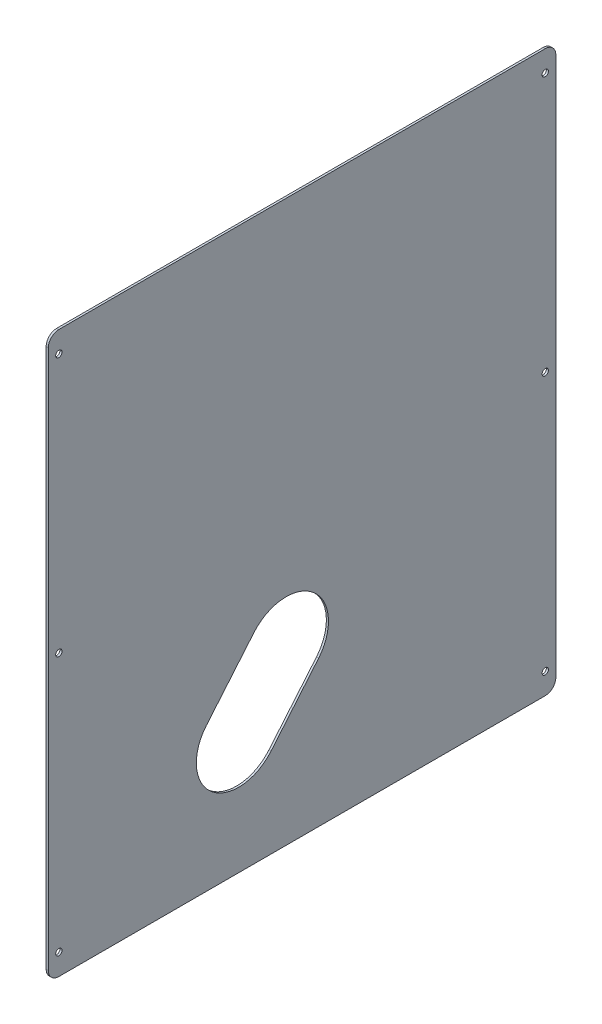
ISO-10303-21;
HEADER;
FILE_DESCRIPTION(('STEP AP214'),'2;1');
FILE_NAME('part.step','',(''),(''),'','','');
FILE_SCHEMA(('AUTOMOTIVE_DESIGN { 1 0 10303 214 1 1 1 1 }'));
ENDSEC;
DATA;
#1=APPLICATION_CONTEXT('core data for automotive mechanical design processes');
#2=APPLICATION_PROTOCOL_DEFINITION('international standard','automotive_design',2000,#1);
#3=PRODUCT_CONTEXT('',#1,'mechanical');
#4=PRODUCT('Part','Part','',(#3));
#5=PRODUCT_RELATED_PRODUCT_CATEGORY('part','',(#4));
#6=PRODUCT_DEFINITION_FORMATION('','',#4);
#7=PRODUCT_DEFINITION_CONTEXT('part definition',#1,'design');
#8=PRODUCT_DEFINITION('design','',#6,#7);
#9=PRODUCT_DEFINITION_SHAPE('','',#8);
#10=(LENGTH_UNIT() NAMED_UNIT(*) SI_UNIT(.MILLI.,.METRE.));
#11=(NAMED_UNIT(*) PLANE_ANGLE_UNIT() SI_UNIT($,.RADIAN.));
#12=(NAMED_UNIT(*) SI_UNIT($,.STERADIAN.) SOLID_ANGLE_UNIT());
#13=UNCERTAINTY_MEASURE_WITH_UNIT(LENGTH_MEASURE(1.E-05),#10,'distance_accuracy_value','');
#14=(GEOMETRIC_REPRESENTATION_CONTEXT(3) GLOBAL_UNCERTAINTY_ASSIGNED_CONTEXT((#13)) GLOBAL_UNIT_ASSIGNED_CONTEXT((#10,
#11,#12)) REPRESENTATION_CONTEXT('',''));
#15=CARTESIAN_POINT('',(0.,0.,0.));
#16=DIRECTION('',(0.,0.,1.));
#17=DIRECTION('',(1.,0.,0.));
#18=AXIS2_PLACEMENT_3D('',#15,#16,#17);
#19=CARTESIAN_POINT('',(-2.,-265.,-240.));
#20=DIRECTION('',(0.,0.,-1.));
#21=DIRECTION('',(-1.,0.,0.));
#22=AXIS2_PLACEMENT_3D('',#19,#20,#21);
#23=PLANE('',#22);
#24=DIRECTION('',(0.,1.,0.));
#25=VECTOR('',#24,1.);
#26=CARTESIAN_POINT('',(0.,-265.,-240.));
#27=LINE('',#26,#25);
#28=CARTESIAN_POINT('',(0.,-255.,-240.));
#29=VERTEX_POINT('',#28);
#30=CARTESIAN_POINT('',(0.,255.,-240.));
#31=VERTEX_POINT('',#30);
#32=EDGE_CURVE('E217',#29,#31,#27,.T.);
#33=ORIENTED_EDGE('',*,*,#32,.F.);
#34=DIRECTION('',(1.,0.,0.));
#35=VECTOR('',#34,1.);
#36=CARTESIAN_POINT('',(-2.,-255.,-240.));
#37=LINE('',#36,#35);
#38=CARTESIAN_POINT('',(-2.,-255.,-240.));
#39=VERTEX_POINT('',#38);
#40=EDGE_CURVE('E308',#29,#39,#37,.F.);
#41=ORIENTED_EDGE('',*,*,#40,.T.);
#42=DIRECTION('',(0.,1.,0.));
#43=VECTOR('',#42,1.);
#44=CARTESIAN_POINT('',(-2.,-265.,-240.));
#45=LINE('',#44,#43);
#46=CARTESIAN_POINT('',(-2.,255.,-240.));
#47=VERTEX_POINT('',#46);
#48=EDGE_CURVE('E237',#39,#47,#45,.T.);
#49=ORIENTED_EDGE('',*,*,#48,.T.);
#50=DIRECTION('',(1.,0.,0.));
#51=VECTOR('',#50,1.);
#52=CARTESIAN_POINT('',(-2.,255.,-240.));
#53=LINE('',#52,#51);
#54=EDGE_CURVE('E304',#47,#31,#53,.T.);
#55=ORIENTED_EDGE('',*,*,#54,.T.);
#56=EDGE_LOOP('',(#33,#41,#49,#55));
#57=FACE_BOUND('',#56,.T.);
#58=ADVANCED_FACE('F42',(#57),#23,.T.);
#59=CARTESIAN_POINT('',(-2.,-265.,240.));
#60=DIRECTION('',(0.,-1.,0.));
#61=DIRECTION('',(0.,0.,-1.));
#62=AXIS2_PLACEMENT_3D('',#59,#60,#61);
#63=PLANE('',#62);
#64=DIRECTION('',(0.,0.,-1.));
#65=VECTOR('',#64,1.);
#66=CARTESIAN_POINT('',(0.,-265.,240.));
#67=LINE('',#66,#65);
#68=CARTESIAN_POINT('',(0.,-265.,230.));
#69=VERTEX_POINT('',#68);
#70=CARTESIAN_POINT('',(0.,-265.,-230.));
#71=VERTEX_POINT('',#70);
#72=EDGE_CURVE('E242',#69,#71,#67,.T.);
#73=ORIENTED_EDGE('',*,*,#72,.F.);
#74=DIRECTION('',(1.,0.,0.));
#75=VECTOR('',#74,1.);
#76=CARTESIAN_POINT('',(-2.,-265.,230.));
#77=LINE('',#76,#75);
#78=CARTESIAN_POINT('',(-2.,-265.,230.));
#79=VERTEX_POINT('',#78);
#80=EDGE_CURVE('E290',#69,#79,#77,.F.);
#81=ORIENTED_EDGE('',*,*,#80,.T.);
#82=DIRECTION('',(0.,0.,-1.));
#83=VECTOR('',#82,1.);
#84=CARTESIAN_POINT('',(-2.,-265.,240.));
#85=LINE('',#84,#83);
#86=CARTESIAN_POINT('',(-2.,-265.,-230.));
#87=VERTEX_POINT('',#86);
#88=EDGE_CURVE('E249',#79,#87,#85,.T.);
#89=ORIENTED_EDGE('',*,*,#88,.T.);
#90=DIRECTION('',(1.,0.,0.));
#91=VECTOR('',#90,1.);
#92=CARTESIAN_POINT('',(-2.,-265.,-230.));
#93=LINE('',#92,#91);
#94=EDGE_CURVE('E286',#87,#71,#93,.T.);
#95=ORIENTED_EDGE('',*,*,#94,.T.);
#96=EDGE_LOOP('',(#73,#81,#89,#95));
#97=FACE_BOUND('',#96,.T.);
#98=ADVANCED_FACE('F334',(#97),#63,.T.);
#99=CARTESIAN_POINT('',(-2.,-265.,240.));
#100=DIRECTION('',(0.,0.,1.));
#101=DIRECTION('',(1.,0.,0.));
#102=AXIS2_PLACEMENT_3D('',#99,#100,#101);
#103=PLANE('',#102);
#104=DIRECTION('',(0.,-1.,0.));
#105=VECTOR('',#104,1.);
#106=CARTESIAN_POINT('',(-2.,-265.,240.));
#107=LINE('',#106,#105);
#108=CARTESIAN_POINT('',(-2.,255.,240.));
#109=VERTEX_POINT('',#108);
#110=CARTESIAN_POINT('',(-2.,-255.,240.));
#111=VERTEX_POINT('',#110);
#112=EDGE_CURVE('E245',#109,#111,#107,.T.);
#113=ORIENTED_EDGE('',*,*,#112,.T.);
#114=DIRECTION('',(1.,0.,0.));
#115=VECTOR('',#114,1.);
#116=CARTESIAN_POINT('',(-2.,-255.,240.));
#117=LINE('',#116,#115);
#118=CARTESIAN_POINT('',(0.,-255.,240.));
#119=VERTEX_POINT('',#118);
#120=EDGE_CURVE('E270',#111,#119,#117,.T.);
#121=ORIENTED_EDGE('',*,*,#120,.T.);
#122=DIRECTION('',(0.,-1.,0.));
#123=VECTOR('',#122,1.);
#124=CARTESIAN_POINT('',(0.,-265.,240.));
#125=LINE('',#124,#123);
#126=CARTESIAN_POINT('',(0.,255.,240.));
#127=VERTEX_POINT('',#126);
#128=EDGE_CURVE('E261',#127,#119,#125,.T.);
#129=ORIENTED_EDGE('',*,*,#128,.F.);
#130=DIRECTION('',(1.,0.,0.));
#131=VECTOR('',#130,1.);
#132=CARTESIAN_POINT('',(-2.,255.,240.));
#133=LINE('',#132,#131);
#134=EDGE_CURVE('E253',#127,#109,#133,.F.);
#135=ORIENTED_EDGE('',*,*,#134,.T.);
#136=EDGE_LOOP('',(#113,#121,#129,#135));
#137=FACE_BOUND('',#136,.T.);
#138=ADVANCED_FACE('F341',(#137),#103,.T.);
#139=CARTESIAN_POINT('',(-2.,265.,240.));
#140=DIRECTION('',(0.,1.,0.));
#141=DIRECTION('',(0.,0.,1.));
#142=AXIS2_PLACEMENT_3D('',#139,#140,#141);
#143=PLANE('',#142);
#144=DIRECTION('',(0.,0.,1.));
#145=VECTOR('',#144,1.);
#146=CARTESIAN_POINT('',(0.,265.,240.));
#147=LINE('',#146,#145);
#148=CARTESIAN_POINT('',(0.,265.,-230.));
#149=VERTEX_POINT('',#148);
#150=CARTESIAN_POINT('',(0.,265.,230.));
#151=VERTEX_POINT('',#150);
#152=EDGE_CURVE('E257',#149,#151,#147,.T.);
#153=ORIENTED_EDGE('',*,*,#152,.F.);
#154=DIRECTION('',(1.,0.,0.));
#155=VECTOR('',#154,1.);
#156=CARTESIAN_POINT('',(-2.,265.,-230.));
#157=LINE('',#156,#155);
#158=CARTESIAN_POINT('',(-2.,265.,-230.));
#159=VERTEX_POINT('',#158);
#160=EDGE_CURVE('E11',#149,#159,#157,.F.);
#161=ORIENTED_EDGE('',*,*,#160,.T.);
#162=DIRECTION('',(0.,0.,1.));
#163=VECTOR('',#162,1.);
#164=CARTESIAN_POINT('',(-2.,265.,240.));
#165=LINE('',#164,#163);
#166=CARTESIAN_POINT('',(-2.,265.,230.));
#167=VERTEX_POINT('',#166);
#168=EDGE_CURVE('E241',#159,#167,#165,.T.);
#169=ORIENTED_EDGE('',*,*,#168,.T.);
#170=DIRECTION('',(1.,0.,0.));
#171=VECTOR('',#170,1.);
#172=CARTESIAN_POINT('',(-2.,265.,230.));
#173=LINE('',#172,#171);
#174=EDGE_CURVE('E51',#167,#151,#173,.T.);
#175=ORIENTED_EDGE('',*,*,#174,.T.);
#176=EDGE_LOOP('',(#153,#161,#169,#175));
#177=FACE_BOUND('',#176,.T.);
#178=ADVANCED_FACE('F314',(#177),#143,.T.);
#179=CARTESIAN_POINT('',(-2.,0.,0.));
#180=DIRECTION('',(-1.,0.,0.));
#181=DIRECTION('',(0.,0.,1.));
#182=AXIS2_PLACEMENT_3D('',#179,#180,#181);
#183=PLANE('',#182);
#184=CARTESIAN_POINT('',(-2.,-155.,60.));
#185=DIRECTION('',(1.,0.,0.));
#186=DIRECTION('',(0.,0.,-1.));
#187=AXIS2_PLACEMENT_3D('',#184,#185,#186);
#188=CIRCLE('',#187,40.);
#189=CARTESIAN_POINT('',(-2.,-129.288495612539,90.6417777247592));
#190=VERTEX_POINT('',#189);
#191=CARTESIAN_POINT('',(-2.,-180.711504387462,29.3582222752409));
#192=VERTEX_POINT('',#191);
#193=EDGE_CURVE('E136',#190,#192,#188,.T.);
#194=ORIENTED_EDGE('',*,*,#193,.T.);
#195=DIRECTION('',(0.,0.766044443118979,-0.642787609686538));
#196=VECTOR('',#195,1.);
#197=CARTESIAN_POINT('',(-2.,-180.711504387462,29.3582222752409));
#198=LINE('',#197,#196);
#199=CARTESIAN_POINT('',(-2.,-127.088393369133,-15.6369104028168));
#200=VERTEX_POINT('',#199);
#201=EDGE_CURVE('E149',#192,#200,#198,.T.);
#202=ORIENTED_EDGE('',*,*,#201,.T.);
#203=CARTESIAN_POINT('',(-2.,-101.376888981671,15.0048673219424));
#204=DIRECTION('',(1.,0.,0.));
#205=DIRECTION('',(0.,0.,-1.));
#206=AXIS2_PLACEMENT_3D('',#203,#204,#205);
#207=CIRCLE('',#206,40.);
#208=CARTESIAN_POINT('',(-2.,-75.6653845942101,45.6466450467015));
#209=VERTEX_POINT('',#208);
#210=EDGE_CURVE('E154',#200,#209,#207,.T.);
#211=ORIENTED_EDGE('',*,*,#210,.T.);
#212=DIRECTION('',(0.,-0.766044443118979,0.642787609686538));
#213=VECTOR('',#212,1.);
#214=CARTESIAN_POINT('',(-2.,-129.288495612539,90.6417777247592));
#215=LINE('',#214,#213);
#216=EDGE_CURVE('E145',#209,#190,#215,.T.);
#217=ORIENTED_EDGE('',*,*,#216,.T.);
#218=EDGE_LOOP('',(#194,#202,#211,#217));
#219=FACE_BOUND('',#218,.T.);
#220=CARTESIAN_POINT('',(-2.,245.,-230.));
#221=DIRECTION('',(-1.,0.,0.));
#222=DIRECTION('',(0.,0.,1.));
#223=AXIS2_PLACEMENT_3D('',#220,#221,#222);
#224=CIRCLE('',#223,2.99999999999999);
#225=CARTESIAN_POINT('',(-2.,245.,-227.));
#226=VERTEX_POINT('',#225);
#227=EDGE_CURVE('E193',#226,#226,#224,.T.);
#228=ORIENTED_EDGE('',*,*,#227,.F.);
#229=EDGE_LOOP('',(#228));
#230=FACE_BOUND('',#229,.T.);
#231=CARTESIAN_POINT('',(-2.,0.,-230.));
#232=DIRECTION('',(-1.,0.,0.));
#233=DIRECTION('',(0.,0.,1.));
#234=AXIS2_PLACEMENT_3D('',#231,#232,#233);
#235=CIRCLE('',#234,2.99999999999999);
#236=CARTESIAN_POINT('',(-2.,0.,-227.));
#237=VERTEX_POINT('',#236);
#238=EDGE_CURVE('E194',#237,#237,#235,.T.);
#239=ORIENTED_EDGE('',*,*,#238,.F.);
#240=EDGE_LOOP('',(#239));
#241=FACE_BOUND('',#240,.T.);
#242=CARTESIAN_POINT('',(-2.,-245.,-230.));
#243=DIRECTION('',(-1.,0.,0.));
#244=DIRECTION('',(0.,0.,1.));
#245=AXIS2_PLACEMENT_3D('',#242,#243,#244);
#246=CIRCLE('',#245,2.99999999999999);
#247=CARTESIAN_POINT('',(-2.,-245.,-227.));
#248=VERTEX_POINT('',#247);
#249=EDGE_CURVE('E203',#248,#248,#246,.T.);
#250=ORIENTED_EDGE('',*,*,#249,.F.);
#251=EDGE_LOOP('',(#250));
#252=FACE_BOUND('',#251,.T.);
#253=CARTESIAN_POINT('',(-2.,245.,230.));
#254=DIRECTION('',(-1.,0.,0.));
#255=DIRECTION('',(0.,0.,1.));
#256=AXIS2_PLACEMENT_3D('',#253,#254,#255);
#257=CIRCLE('',#256,2.99999999999999);
#258=CARTESIAN_POINT('',(-2.,245.,233.));
#259=VERTEX_POINT('',#258);
#260=EDGE_CURVE('E218',#259,#259,#257,.F.);
#261=ORIENTED_EDGE('',*,*,#260,.T.);
#262=EDGE_LOOP('',(#261));
#263=FACE_BOUND('',#262,.T.);
#264=CARTESIAN_POINT('',(-2.,0.,230.));
#265=DIRECTION('',(-1.,0.,0.));
#266=DIRECTION('',(0.,0.,1.));
#267=AXIS2_PLACEMENT_3D('',#264,#265,#266);
#268=CIRCLE('',#267,2.99999999999999);
#269=CARTESIAN_POINT('',(-2.,0.,233.));
#270=VERTEX_POINT('',#269);
#271=EDGE_CURVE('E226',#270,#270,#268,.F.);
#272=ORIENTED_EDGE('',*,*,#271,.T.);
#273=EDGE_LOOP('',(#272));
#274=FACE_BOUND('',#273,.T.);
#275=CARTESIAN_POINT('',(-2.,-245.,230.));
#276=DIRECTION('',(-1.,0.,0.));
#277=DIRECTION('',(0.,0.,1.));
#278=AXIS2_PLACEMENT_3D('',#275,#276,#277);
#279=CIRCLE('',#278,2.99999999999999);
#280=CARTESIAN_POINT('',(-2.,-245.,233.));
#281=VERTEX_POINT('',#280);
#282=EDGE_CURVE('E198',#281,#281,#279,.F.);
#283=ORIENTED_EDGE('',*,*,#282,.T.);
#284=EDGE_LOOP('',(#283));
#285=FACE_BOUND('',#284,.T.);
#286=ORIENTED_EDGE('',*,*,#88,.F.);
#287=CARTESIAN_POINT('',(-2.,-255.,230.));
#288=DIRECTION('',(-1.,0.,0.));
#289=DIRECTION('',(0.,0.,1.));
#290=AXIS2_PLACEMENT_3D('',#287,#288,#289);
#291=CIRCLE('',#290,10.);
#292=EDGE_CURVE('E301',#79,#111,#291,.T.);
#293=ORIENTED_EDGE('',*,*,#292,.T.);
#294=ORIENTED_EDGE('',*,*,#112,.F.);
#295=CARTESIAN_POINT('',(-2.,255.,230.));
#296=DIRECTION('',(-1.,0.,0.));
#297=DIRECTION('',(0.,0.,1.));
#298=AXIS2_PLACEMENT_3D('',#295,#296,#297);
#299=CIRCLE('',#298,10.);
#300=EDGE_CURVE('E58',#109,#167,#299,.T.);
#301=ORIENTED_EDGE('',*,*,#300,.T.);
#302=ORIENTED_EDGE('',*,*,#168,.F.);
#303=CARTESIAN_POINT('',(-2.,255.,-230.));
#304=DIRECTION('',(-1.,0.,0.));
#305=DIRECTION('',(0.,0.,1.));
#306=AXIS2_PLACEMENT_3D('',#303,#304,#305);
#307=CIRCLE('',#306,10.);
#308=EDGE_CURVE('E295',#159,#47,#307,.T.);
#309=ORIENTED_EDGE('',*,*,#308,.T.);
#310=ORIENTED_EDGE('',*,*,#48,.F.);
#311=CARTESIAN_POINT('',(-2.,-255.,-230.));
#312=DIRECTION('',(-1.,0.,0.));
#313=DIRECTION('',(0.,0.,1.));
#314=AXIS2_PLACEMENT_3D('',#311,#312,#313);
#315=CIRCLE('',#314,10.);
#316=EDGE_CURVE('E298',#39,#87,#315,.T.);
#317=ORIENTED_EDGE('',*,*,#316,.T.);
#318=EDGE_LOOP('',(#286,#293,#294,#301,#302,#309,#310,#317));
#319=FACE_BOUND('',#318,.T.);
#320=ADVANCED_FACE('F156',(#219,#230,#241,#252,#263,#274,#285,#319),#183,.T.);
#321=CARTESIAN_POINT('',(0.,0.,0.));
#322=DIRECTION('',(-1.,0.,0.));
#323=DIRECTION('',(0.,0.,1.));
#324=AXIS2_PLACEMENT_3D('',#321,#322,#323);
#325=PLANE('',#324);
#326=DIRECTION('',(0.,0.766044443118979,-0.642787609686538));
#327=VECTOR('',#326,1.);
#328=CARTESIAN_POINT('',(0.,-180.711504387462,29.3582222752409));
#329=LINE('',#328,#327);
#330=CARTESIAN_POINT('',(0.,-180.711504387462,29.3582222752409));
#331=VERTEX_POINT('',#330);
#332=CARTESIAN_POINT('',(0.,-127.088393369133,-15.6369104028168));
#333=VERTEX_POINT('',#332);
#334=EDGE_CURVE('E174',#331,#333,#329,.T.);
#335=ORIENTED_EDGE('',*,*,#334,.F.);
#336=CARTESIAN_POINT('',(0.,-155.,60.));
#337=DIRECTION('',(1.,0.,0.));
#338=DIRECTION('',(0.,0.,-1.));
#339=AXIS2_PLACEMENT_3D('',#336,#337,#338);
#340=CIRCLE('',#339,40.);
#341=CARTESIAN_POINT('',(0.,-129.288495612539,90.6417777247592));
#342=VERTEX_POINT('',#341);
#343=EDGE_CURVE('E139',#342,#331,#340,.T.);
#344=ORIENTED_EDGE('',*,*,#343,.F.);
#345=DIRECTION('',(0.,-0.766044443118979,0.642787609686538));
#346=VECTOR('',#345,1.);
#347=CARTESIAN_POINT('',(0.,-129.288495612539,90.6417777247592));
#348=LINE('',#347,#346);
#349=CARTESIAN_POINT('',(0.,-75.6653845942101,45.6466450467015));
#350=VERTEX_POINT('',#349);
#351=EDGE_CURVE('E160',#350,#342,#348,.T.);
#352=ORIENTED_EDGE('',*,*,#351,.F.);
#353=CARTESIAN_POINT('',(0.,-101.376888981671,15.0048673219424));
#354=DIRECTION('',(1.,0.,0.));
#355=DIRECTION('',(0.,0.,-1.));
#356=AXIS2_PLACEMENT_3D('',#353,#354,#355);
#357=CIRCLE('',#356,40.);
#358=EDGE_CURVE('E165',#333,#350,#357,.T.);
#359=ORIENTED_EDGE('',*,*,#358,.F.);
#360=EDGE_LOOP('',(#335,#344,#352,#359));
#361=FACE_BOUND('',#360,.T.);
#362=CARTESIAN_POINT('',(0.,245.,-230.));
#363=DIRECTION('',(-1.,0.,0.));
#364=DIRECTION('',(0.,0.,1.));
#365=AXIS2_PLACEMENT_3D('',#362,#363,#364);
#366=CIRCLE('',#365,2.99999999999999);
#367=CARTESIAN_POINT('',(0.,245.,-227.));
#368=VERTEX_POINT('',#367);
#369=EDGE_CURVE('E189',#368,#368,#366,.T.);
#370=ORIENTED_EDGE('',*,*,#369,.T.);
#371=EDGE_LOOP('',(#370));
#372=FACE_BOUND('',#371,.T.);
#373=CARTESIAN_POINT('',(0.,0.,-230.));
#374=DIRECTION('',(-1.,0.,0.));
#375=DIRECTION('',(0.,0.,1.));
#376=AXIS2_PLACEMENT_3D('',#373,#374,#375);
#377=CIRCLE('',#376,2.99999999999999);
#378=CARTESIAN_POINT('',(0.,0.,-227.));
#379=VERTEX_POINT('',#378);
#380=EDGE_CURVE('E199',#379,#379,#377,.T.);
#381=ORIENTED_EDGE('',*,*,#380,.T.);
#382=EDGE_LOOP('',(#381));
#383=FACE_BOUND('',#382,.T.);
#384=CARTESIAN_POINT('',(0.,-245.,-230.));
#385=DIRECTION('',(-1.,0.,0.));
#386=DIRECTION('',(0.,0.,1.));
#387=AXIS2_PLACEMENT_3D('',#384,#385,#386);
#388=CIRCLE('',#387,2.99999999999999);
#389=CARTESIAN_POINT('',(0.,-245.,-227.));
#390=VERTEX_POINT('',#389);
#391=EDGE_CURVE('E183',#390,#390,#388,.T.);
#392=ORIENTED_EDGE('',*,*,#391,.T.);
#393=EDGE_LOOP('',(#392));
#394=FACE_BOUND('',#393,.T.);
#395=CARTESIAN_POINT('',(0.,245.,230.));
#396=DIRECTION('',(1.,0.,0.));
#397=DIRECTION('',(0.,0.,-1.));
#398=AXIS2_PLACEMENT_3D('',#395,#396,#397);
#399=CIRCLE('',#398,2.99999999999999);
#400=CARTESIAN_POINT('',(0.,245.,227.));
#401=VERTEX_POINT('',#400);
#402=EDGE_CURVE('E213',#401,#401,#399,.T.);
#403=ORIENTED_EDGE('',*,*,#402,.F.);
#404=EDGE_LOOP('',(#403));
#405=FACE_BOUND('',#404,.T.);
#406=CARTESIAN_POINT('',(0.,0.,230.));
#407=DIRECTION('',(1.,0.,0.));
#408=DIRECTION('',(0.,0.,-1.));
#409=AXIS2_PLACEMENT_3D('',#406,#407,#408);
#410=CIRCLE('',#409,2.99999999999999);
#411=CARTESIAN_POINT('',(0.,0.,227.));
#412=VERTEX_POINT('',#411);
#413=EDGE_CURVE('E222',#412,#412,#410,.T.);
#414=ORIENTED_EDGE('',*,*,#413,.F.);
#415=EDGE_LOOP('',(#414));
#416=FACE_BOUND('',#415,.T.);
#417=CARTESIAN_POINT('',(0.,-245.,230.));
#418=DIRECTION('',(1.,0.,0.));
#419=DIRECTION('',(0.,0.,-1.));
#420=AXIS2_PLACEMENT_3D('',#417,#418,#419);
#421=CIRCLE('',#420,2.99999999999999);
#422=CARTESIAN_POINT('',(0.,-245.,227.));
#423=VERTEX_POINT('',#422);
#424=EDGE_CURVE('E230',#423,#423,#421,.T.);
#425=ORIENTED_EDGE('',*,*,#424,.F.);
#426=EDGE_LOOP('',(#425));
#427=FACE_BOUND('',#426,.T.);
#428=ORIENTED_EDGE('',*,*,#128,.T.);
#429=CARTESIAN_POINT('',(0.,-255.,230.));
#430=DIRECTION('',(-1.,0.,0.));
#431=DIRECTION('',(0.,0.,1.));
#432=AXIS2_PLACEMENT_3D('',#429,#430,#431);
#433=CIRCLE('',#432,10.);
#434=EDGE_CURVE('E283',#119,#69,#433,.F.);
#435=ORIENTED_EDGE('',*,*,#434,.T.);
#436=ORIENTED_EDGE('',*,*,#72,.T.);
#437=CARTESIAN_POINT('',(0.,-255.,-230.));
#438=DIRECTION('',(-1.,0.,0.));
#439=DIRECTION('',(0.,0.,1.));
#440=AXIS2_PLACEMENT_3D('',#437,#438,#439);
#441=CIRCLE('',#440,10.);
#442=EDGE_CURVE('E280',#71,#29,#441,.F.);
#443=ORIENTED_EDGE('',*,*,#442,.T.);
#444=ORIENTED_EDGE('',*,*,#32,.T.);
#445=CARTESIAN_POINT('',(0.,255.,-230.));
#446=DIRECTION('',(-1.,0.,0.));
#447=DIRECTION('',(0.,0.,1.));
#448=AXIS2_PLACEMENT_3D('',#445,#446,#447);
#449=CIRCLE('',#448,10.);
#450=EDGE_CURVE('E277',#31,#149,#449,.F.);
#451=ORIENTED_EDGE('',*,*,#450,.T.);
#452=ORIENTED_EDGE('',*,*,#152,.T.);
#453=CARTESIAN_POINT('',(0.,255.,230.));
#454=DIRECTION('',(-1.,0.,0.));
#455=DIRECTION('',(0.,0.,1.));
#456=AXIS2_PLACEMENT_3D('',#453,#454,#455);
#457=CIRCLE('',#456,10.);
#458=EDGE_CURVE('E274',#151,#127,#457,.F.);
#459=ORIENTED_EDGE('',*,*,#458,.T.);
#460=EDGE_LOOP('',(#428,#435,#436,#443,#444,#451,#452,#459));
#461=FACE_BOUND('',#460,.T.);
#462=ADVANCED_FACE('F317',(#361,#372,#383,#394,#405,#416,#427,#461),#325,.F.);
#463=CARTESIAN_POINT('',(-2.00099999999992,-245.,230.));
#464=DIRECTION('',(1.,0.,0.));
#465=DIRECTION('',(0.,0.,-1.));
#466=AXIS2_PLACEMENT_3D('',#463,#464,#465);
#467=CYLINDRICAL_SURFACE('',#466,2.99999999999999);
#468=ORIENTED_EDGE('',*,*,#282,.F.);
#469=EDGE_LOOP('',(#468));
#470=FACE_BOUND('',#469,.T.);
#471=ORIENTED_EDGE('',*,*,#424,.T.);
#472=EDGE_LOOP('',(#471));
#473=FACE_BOUND('',#472,.T.);
#474=ADVANCED_FACE('F494',(#470,#473),#467,.F.);
#475=CARTESIAN_POINT('',(-2.00099999999992,0.,230.));
#476=DIRECTION('',(1.,0.,0.));
#477=DIRECTION('',(0.,0.,-1.));
#478=AXIS2_PLACEMENT_3D('',#475,#476,#477);
#479=CYLINDRICAL_SURFACE('',#478,2.99999999999999);
#480=ORIENTED_EDGE('',*,*,#271,.F.);
#481=EDGE_LOOP('',(#480));
#482=FACE_BOUND('',#481,.T.);
#483=ORIENTED_EDGE('',*,*,#413,.T.);
#484=EDGE_LOOP('',(#483));
#485=FACE_BOUND('',#484,.T.);
#486=ADVANCED_FACE('F483',(#482,#485),#479,.F.);
#487=CARTESIAN_POINT('',(-2.00099999999992,245.,230.));
#488=DIRECTION('',(1.,0.,0.));
#489=DIRECTION('',(0.,0.,-1.));
#490=AXIS2_PLACEMENT_3D('',#487,#488,#489);
#491=CYLINDRICAL_SURFACE('',#490,2.99999999999999);
#492=ORIENTED_EDGE('',*,*,#260,.F.);
#493=EDGE_LOOP('',(#492));
#494=FACE_BOUND('',#493,.T.);
#495=ORIENTED_EDGE('',*,*,#402,.T.);
#496=EDGE_LOOP('',(#495));
#497=FACE_BOUND('',#496,.T.);
#498=ADVANCED_FACE('F472',(#494,#497),#491,.F.);
#499=CARTESIAN_POINT('',(-2.00100000000003,-245.,-230.));
#500=DIRECTION('',(1.,0.,0.));
#501=DIRECTION('',(0.,0.,-1.));
#502=AXIS2_PLACEMENT_3D('',#499,#500,#501);
#503=CYLINDRICAL_SURFACE('',#502,2.99999999999999);
#504=ORIENTED_EDGE('',*,*,#249,.T.);
#505=EDGE_LOOP('',(#504));
#506=FACE_BOUND('',#505,.T.);
#507=ORIENTED_EDGE('',*,*,#391,.F.);
#508=EDGE_LOOP('',(#507));
#509=FACE_BOUND('',#508,.T.);
#510=ADVANCED_FACE('F461',(#506,#509),#503,.F.);
#511=CARTESIAN_POINT('',(-2.00100000000003,0.,-230.));
#512=DIRECTION('',(1.,0.,0.));
#513=DIRECTION('',(0.,0.,-1.));
#514=AXIS2_PLACEMENT_3D('',#511,#512,#513);
#515=CYLINDRICAL_SURFACE('',#514,2.99999999999999);
#516=ORIENTED_EDGE('',*,*,#238,.T.);
#517=EDGE_LOOP('',(#516));
#518=FACE_BOUND('',#517,.T.);
#519=ORIENTED_EDGE('',*,*,#380,.F.);
#520=EDGE_LOOP('',(#519));
#521=FACE_BOUND('',#520,.T.);
#522=ADVANCED_FACE('F450',(#518,#521),#515,.F.);
#523=CARTESIAN_POINT('',(-2.00100000000003,245.,-230.));
#524=DIRECTION('',(1.,0.,0.));
#525=DIRECTION('',(0.,0.,-1.));
#526=AXIS2_PLACEMENT_3D('',#523,#524,#525);
#527=CYLINDRICAL_SURFACE('',#526,2.99999999999999);
#528=ORIENTED_EDGE('',*,*,#227,.T.);
#529=EDGE_LOOP('',(#528));
#530=FACE_BOUND('',#529,.T.);
#531=ORIENTED_EDGE('',*,*,#369,.F.);
#532=EDGE_LOOP('',(#531));
#533=FACE_BOUND('',#532,.T.);
#534=ADVANCED_FACE('F440',(#530,#533),#527,.F.);
#535=CARTESIAN_POINT('',(-2.,-155.,60.));
#536=DIRECTION('',(1.,0.,0.));
#537=DIRECTION('',(0.,0.,-1.));
#538=AXIS2_PLACEMENT_3D('',#535,#536,#537);
#539=CYLINDRICAL_SURFACE('',#538,40.);
#540=ORIENTED_EDGE('',*,*,#343,.T.);
#541=DIRECTION('',(1.,0.,0.));
#542=VECTOR('',#541,1.);
#543=CARTESIAN_POINT('',(-2.,-180.711504387462,29.3582222752409));
#544=LINE('',#543,#542);
#545=EDGE_CURVE('E132',#192,#331,#544,.T.);
#546=ORIENTED_EDGE('',*,*,#545,.F.);
#547=ORIENTED_EDGE('',*,*,#193,.F.);
#548=DIRECTION('',(1.,0.,0.));
#549=VECTOR('',#548,1.);
#550=CARTESIAN_POINT('',(-2.,-129.288495612539,90.6417777247592));
#551=LINE('',#550,#549);
#552=EDGE_CURVE('E180',#190,#342,#551,.T.);
#553=ORIENTED_EDGE('',*,*,#552,.T.);
#554=EDGE_LOOP('',(#540,#546,#547,#553));
#555=FACE_BOUND('',#554,.T.);
#556=ADVANCED_FACE('F134',(#555),#539,.F.);
#557=CARTESIAN_POINT('',(-2.,-129.288495612539,90.6417777247592));
#558=DIRECTION('',(0.,0.642787609686538,0.766044443118979));
#559=DIRECTION('',(0.,-0.766044443118979,0.642787609686538));
#560=AXIS2_PLACEMENT_3D('',#557,#558,#559);
#561=PLANE('',#560);
#562=ORIENTED_EDGE('',*,*,#351,.T.);
#563=ORIENTED_EDGE('',*,*,#552,.F.);
#564=ORIENTED_EDGE('',*,*,#216,.F.);
#565=DIRECTION('',(1.,0.,0.));
#566=VECTOR('',#565,1.);
#567=CARTESIAN_POINT('',(-2.,-75.6653845942101,45.6466450467015));
#568=LINE('',#567,#566);
#569=EDGE_CURVE('E184',#209,#350,#568,.T.);
#570=ORIENTED_EDGE('',*,*,#569,.T.);
#571=EDGE_LOOP('',(#562,#563,#564,#570));
#572=FACE_BOUND('',#571,.T.);
#573=ADVANCED_FACE('F419',(#572),#561,.F.);
#574=CARTESIAN_POINT('',(-2.,-101.376888981671,15.0048673219424));
#575=DIRECTION('',(1.,0.,0.));
#576=DIRECTION('',(0.,0.,-1.));
#577=AXIS2_PLACEMENT_3D('',#574,#575,#576);
#578=CYLINDRICAL_SURFACE('',#577,40.);
#579=ORIENTED_EDGE('',*,*,#358,.T.);
#580=ORIENTED_EDGE('',*,*,#569,.F.);
#581=ORIENTED_EDGE('',*,*,#210,.F.);
#582=DIRECTION('',(1.,0.,0.));
#583=VECTOR('',#582,1.);
#584=CARTESIAN_POINT('',(-2.,-127.088393369133,-15.6369104028168));
#585=LINE('',#584,#583);
#586=EDGE_CURVE('E144',#200,#333,#585,.T.);
#587=ORIENTED_EDGE('',*,*,#586,.T.);
#588=EDGE_LOOP('',(#579,#580,#581,#587));
#589=FACE_BOUND('',#588,.T.);
#590=ADVANCED_FACE('F409',(#589),#578,.F.);
#591=CARTESIAN_POINT('',(-2.,-180.711504387462,29.3582222752409));
#592=DIRECTION('',(0.,-0.642787609686538,-0.766044443118979));
#593=DIRECTION('',(0.,0.766044443118979,-0.642787609686538));
#594=AXIS2_PLACEMENT_3D('',#591,#592,#593);
#595=PLANE('',#594);
#596=ORIENTED_EDGE('',*,*,#334,.T.);
#597=ORIENTED_EDGE('',*,*,#586,.F.);
#598=ORIENTED_EDGE('',*,*,#201,.F.);
#599=ORIENTED_EDGE('',*,*,#545,.T.);
#600=EDGE_LOOP('',(#596,#597,#598,#599));
#601=FACE_BOUND('',#600,.T.);
#602=ADVANCED_FACE('F150',(#601),#595,.F.);
#603=CARTESIAN_POINT('',(-2.,-255.,230.));
#604=DIRECTION('',(1.,0.,0.));
#605=DIRECTION('',(0.,0.,-1.));
#606=AXIS2_PLACEMENT_3D('',#603,#604,#605);
#607=CYLINDRICAL_SURFACE('',#606,10.);
#608=ORIENTED_EDGE('',*,*,#292,.F.);
#609=ORIENTED_EDGE('',*,*,#80,.F.);
#610=ORIENTED_EDGE('',*,*,#434,.F.);
#611=ORIENTED_EDGE('',*,*,#120,.F.);
#612=EDGE_LOOP('',(#608,#609,#610,#611));
#613=FACE_BOUND('',#612,.T.);
#614=ADVANCED_FACE('F339',(#613),#607,.T.);
#615=CARTESIAN_POINT('',(-2.,-255.,-230.));
#616=DIRECTION('',(1.,0.,0.));
#617=DIRECTION('',(0.,0.,-1.));
#618=AXIS2_PLACEMENT_3D('',#615,#616,#617);
#619=CYLINDRICAL_SURFACE('',#618,10.);
#620=ORIENTED_EDGE('',*,*,#316,.F.);
#621=ORIENTED_EDGE('',*,*,#40,.F.);
#622=ORIENTED_EDGE('',*,*,#442,.F.);
#623=ORIENTED_EDGE('',*,*,#94,.F.);
#624=EDGE_LOOP('',(#620,#621,#622,#623));
#625=FACE_BOUND('',#624,.T.);
#626=ADVANCED_FACE('F331',(#625),#619,.T.);
#627=CARTESIAN_POINT('',(-2.,255.,-230.));
#628=DIRECTION('',(1.,0.,0.));
#629=DIRECTION('',(0.,0.,-1.));
#630=AXIS2_PLACEMENT_3D('',#627,#628,#629);
#631=CYLINDRICAL_SURFACE('',#630,10.);
#632=ORIENTED_EDGE('',*,*,#308,.F.);
#633=ORIENTED_EDGE('',*,*,#160,.F.);
#634=ORIENTED_EDGE('',*,*,#450,.F.);
#635=ORIENTED_EDGE('',*,*,#54,.F.);
#636=EDGE_LOOP('',(#632,#633,#634,#635));
#637=FACE_BOUND('',#636,.T.);
#638=ADVANCED_FACE('F323',(#637),#631,.T.);
#639=CARTESIAN_POINT('',(-2.,255.,230.));
#640=DIRECTION('',(1.,0.,0.));
#641=DIRECTION('',(0.,0.,-1.));
#642=AXIS2_PLACEMENT_3D('',#639,#640,#641);
#643=CYLINDRICAL_SURFACE('',#642,10.);
#644=ORIENTED_EDGE('',*,*,#300,.F.);
#645=ORIENTED_EDGE('',*,*,#134,.F.);
#646=ORIENTED_EDGE('',*,*,#458,.F.);
#647=ORIENTED_EDGE('',*,*,#174,.F.);
#648=EDGE_LOOP('',(#644,#645,#646,#647));
#649=FACE_BOUND('',#648,.T.);
#650=ADVANCED_FACE('F44',(#649),#643,.T.);
#651=CLOSED_SHELL('',(#58,#98,#138,#178,#320,#462,#474,#486,#498,#510,#522,#534,#556,#573,#590,
#602,#614,#626,#638,#650));
#652=MANIFOLD_SOLID_BREP('B2',#651);
#653=ADVANCED_BREP_SHAPE_REPRESENTATION('',(#18,#652),#14);
#654=SHAPE_DEFINITION_REPRESENTATION(#9,#653);
ENDSEC;
END-ISO-10303-21;
